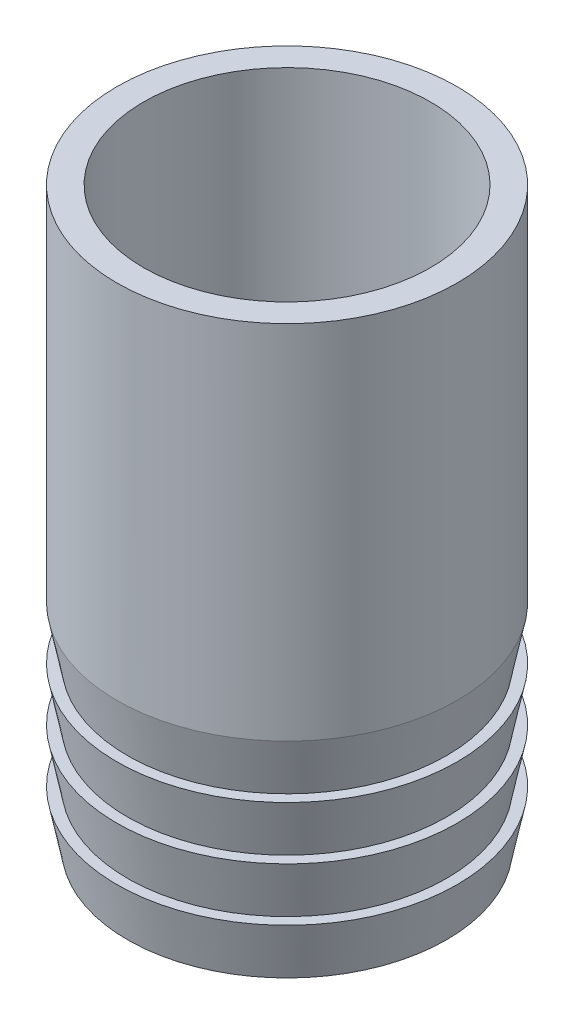
ISO-10303-21;
HEADER;
FILE_DESCRIPTION(('STEP AP214'),'2;1');
FILE_NAME('part.step','',(''),(''),'','','');
FILE_SCHEMA(('AUTOMOTIVE_DESIGN { 1 0 10303 214 1 1 1 1 }'));
ENDSEC;
DATA;
#1=APPLICATION_CONTEXT('core data for automotive mechanical design processes');
#2=APPLICATION_PROTOCOL_DEFINITION('international standard','automotive_design',2000,#1);
#3=PRODUCT_CONTEXT('',#1,'mechanical');
#4=PRODUCT('Part','Part','',(#3));
#5=PRODUCT_RELATED_PRODUCT_CATEGORY('part','',(#4));
#6=PRODUCT_DEFINITION_FORMATION('','',#4);
#7=PRODUCT_DEFINITION_CONTEXT('part definition',#1,'design');
#8=PRODUCT_DEFINITION('design','',#6,#7);
#9=PRODUCT_DEFINITION_SHAPE('','',#8);
#10=(LENGTH_UNIT() NAMED_UNIT(*) SI_UNIT(.MILLI.,.METRE.));
#11=(NAMED_UNIT(*) PLANE_ANGLE_UNIT() SI_UNIT($,.RADIAN.));
#12=(NAMED_UNIT(*) SI_UNIT($,.STERADIAN.) SOLID_ANGLE_UNIT());
#13=UNCERTAINTY_MEASURE_WITH_UNIT(LENGTH_MEASURE(1.E-05),#10,'distance_accuracy_value','');
#14=(GEOMETRIC_REPRESENTATION_CONTEXT(3) GLOBAL_UNCERTAINTY_ASSIGNED_CONTEXT((#13)) GLOBAL_UNIT_ASSIGNED_CONTEXT((#10,
#11,#12)) REPRESENTATION_CONTEXT('',''));
#15=CARTESIAN_POINT('',(0.,0.,0.));
#16=DIRECTION('',(0.,0.,1.));
#17=DIRECTION('',(1.,0.,0.));
#18=AXIS2_PLACEMENT_3D('',#15,#16,#17);
#19=CARTESIAN_POINT('',(0.,0.,0.));
#20=DIRECTION('',(0.,1.,0.));
#21=DIRECTION('',(0.,0.,1.));
#22=AXIS2_PLACEMENT_3D('',#19,#20,#21);
#23=PLANE('',#22);
#24=CARTESIAN_POINT('',(0.,0.,0.));
#25=DIRECTION('',(0.,1.,0.));
#26=DIRECTION('',(0.,0.,1.));
#27=AXIS2_PLACEMENT_3D('',#24,#25,#26);
#28=CIRCLE('',#27,13.5);
#29=CARTESIAN_POINT('',(0.,0.,13.5));
#30=VERTEX_POINT('',#29);
#31=EDGE_CURVE('E52',#30,#30,#28,.T.);
#32=ORIENTED_EDGE('',*,*,#31,.T.);
#33=EDGE_LOOP('',(#32));
#34=FACE_BOUND('',#33,.T.);
#35=CARTESIAN_POINT('',(0.,-1.53647213295989E-13,0.));
#36=DIRECTION('',(0.,-1.,0.));
#37=DIRECTION('',(1.,0.,0.));
#38=AXIS2_PLACEMENT_3D('',#35,#36,#37);
#39=CIRCLE('',#38,15.0000000000002);
#40=CARTESIAN_POINT('',(15.0000000000002,0.,0.));
#41=VERTEX_POINT('',#40);
#42=EDGE_CURVE('E76',#41,#41,#39,.T.);
#43=ORIENTED_EDGE('',*,*,#42,.T.);
#44=EDGE_LOOP('',(#43));
#45=FACE_BOUND('',#44,.T.);
#46=ADVANCED_FACE('F39',(#34,#45),#23,.F.);
#47=CARTESIAN_POINT('',(0.,54.,0.));
#48=DIRECTION('',(0.,1.,0.));
#49=DIRECTION('',(0.,0.,1.));
#50=AXIS2_PLACEMENT_3D('',#47,#48,#49);
#51=PLANE('',#50);
#52=CARTESIAN_POINT('',(0.,54.,0.));
#53=DIRECTION('',(0.,1.,0.));
#54=DIRECTION('',(0.,0.,1.));
#55=AXIS2_PLACEMENT_3D('',#52,#53,#54);
#56=CIRCLE('',#55,16.);
#57=CARTESIAN_POINT('',(0.,54.,16.));
#58=VERTEX_POINT('',#57);
#59=EDGE_CURVE('E10',#58,#58,#56,.T.);
#60=ORIENTED_EDGE('',*,*,#59,.T.);
#61=EDGE_LOOP('',(#60));
#62=FACE_BOUND('',#61,.T.);
#63=CARTESIAN_POINT('',(0.,54.,0.));
#64=DIRECTION('',(0.,1.,0.));
#65=DIRECTION('',(0.,0.,1.));
#66=AXIS2_PLACEMENT_3D('',#63,#64,#65);
#67=CIRCLE('',#66,13.5);
#68=CARTESIAN_POINT('',(0.,54.,13.5));
#69=VERTEX_POINT('',#68);
#70=EDGE_CURVE('E47',#69,#69,#67,.T.);
#71=ORIENTED_EDGE('',*,*,#70,.F.);
#72=EDGE_LOOP('',(#71));
#73=FACE_BOUND('',#72,.T.);
#74=ADVANCED_FACE('F116',(#62,#73),#51,.T.);
#75=CARTESIAN_POINT('',(0.,54.,0.));
#76=DIRECTION('',(0.,-1.,0.));
#77=DIRECTION('',(0.,0.,-1.));
#78=AXIS2_PLACEMENT_3D('',#75,#76,#77);
#79=CYLINDRICAL_SURFACE('',#78,16.);
#80=CARTESIAN_POINT('',(-2.09488880330586E-13,19.9999999999998,0.));
#81=DIRECTION('',(0.,-1.,0.));
#82=DIRECTION('',(1.,0.,0.));
#83=AXIS2_PLACEMENT_3D('',#80,#81,#82);
#84=CIRCLE('',#83,16.0000000000002);
#85=CARTESIAN_POINT('',(16.,20.,0.));
#86=VERTEX_POINT('',#85);
#87=EDGE_CURVE('E60',#86,#86,#84,.T.);
#88=ORIENTED_EDGE('',*,*,#87,.F.);
#89=EDGE_LOOP('',(#88));
#90=FACE_BOUND('',#89,.T.);
#91=ORIENTED_EDGE('',*,*,#59,.F.);
#92=EDGE_LOOP('',(#91));
#93=FACE_BOUND('',#92,.T.);
#94=ADVANCED_FACE('F41',(#90,#93),#79,.T.);
#95=CARTESIAN_POINT('',(0.,54.,0.));
#96=DIRECTION('',(0.,-1.,0.));
#97=DIRECTION('',(0.,0.,-1.));
#98=AXIS2_PLACEMENT_3D('',#95,#96,#97);
#99=CYLINDRICAL_SURFACE('',#98,13.5);
#100=ORIENTED_EDGE('',*,*,#70,.T.);
#101=EDGE_LOOP('',(#100));
#102=FACE_BOUND('',#101,.T.);
#103=ORIENTED_EDGE('',*,*,#31,.F.);
#104=EDGE_LOOP('',(#103));
#105=FACE_BOUND('',#104,.T.);
#106=ADVANCED_FACE('F105',(#102,#105),#99,.F.);
#107=CARTESIAN_POINT('',(15.,15.,0.));
#108=DIRECTION('',(0.,-1.,0.));
#109=DIRECTION('',(1.,0.,0.));
#110=AXIS2_PLACEMENT_3D('',#107,#108,#109);
#111=PLANE('',#110);
#112=CARTESIAN_POINT('',(-1.57116660247939E-13,14.9999999999998,0.));
#113=DIRECTION('',(0.,-1.,0.));
#114=DIRECTION('',(1.,0.,0.));
#115=AXIS2_PLACEMENT_3D('',#112,#113,#114);
#116=CIRCLE('',#115,16.0000000000002);
#117=CARTESIAN_POINT('',(16.,15.,0.));
#118=VERTEX_POINT('',#117);
#119=EDGE_CURVE('E84',#118,#118,#116,.T.);
#120=ORIENTED_EDGE('',*,*,#119,.F.);
#121=EDGE_LOOP('',(#120));
#122=FACE_BOUND('',#121,.T.);
#123=CARTESIAN_POINT('',(-1.57116660247939E-13,14.9999999999998,0.));
#124=DIRECTION('',(0.,-1.,0.));
#125=DIRECTION('',(1.,0.,0.));
#126=AXIS2_PLACEMENT_3D('',#123,#124,#125);
#127=CIRCLE('',#126,15.0000000000002);
#128=CARTESIAN_POINT('',(15.,15.,0.));
#129=VERTEX_POINT('',#128);
#130=EDGE_CURVE('E64',#129,#129,#127,.T.);
#131=ORIENTED_EDGE('',*,*,#130,.T.);
#132=EDGE_LOOP('',(#131));
#133=FACE_BOUND('',#132,.T.);
#134=ADVANCED_FACE('F101',(#122,#133),#111,.F.);
#135=CARTESIAN_POINT('',(-2.09488880330586E-13,19.9999999999998,0.));
#136=DIRECTION('',(0.,1.,0.));
#137=DIRECTION('',(-1.,0.,0.));
#138=AXIS2_PLACEMENT_3D('',#135,#136,#137);
#139=CONICAL_SURFACE('',#138,16.0000000000002,0.197395559849891);
#140=ORIENTED_EDGE('',*,*,#130,.F.);
#141=EDGE_LOOP('',(#140));
#142=FACE_BOUND('',#141,.T.);
#143=ORIENTED_EDGE('',*,*,#87,.T.);
#144=EDGE_LOOP('',(#143));
#145=FACE_BOUND('',#144,.T.);
#146=ADVANCED_FACE('F104',(#142,#145),#139,.T.);
#147=CARTESIAN_POINT('',(15.0000000000001,9.99999999999999,0.));
#148=DIRECTION('',(0.,-1.,0.));
#149=DIRECTION('',(1.,0.,0.));
#150=AXIS2_PLACEMENT_3D('',#147,#148,#149);
#151=PLANE('',#150);
#152=CARTESIAN_POINT('',(-1.04744440165292E-13,9.99999999999983,0.));
#153=DIRECTION('',(0.,-1.,0.));
#154=DIRECTION('',(1.,0.,0.));
#155=AXIS2_PLACEMENT_3D('',#152,#153,#154);
#156=CIRCLE('',#155,16.0000000000002);
#157=CARTESIAN_POINT('',(16.0000000000001,10.,0.));
#158=VERTEX_POINT('',#157);
#159=EDGE_CURVE('E80',#158,#158,#156,.T.);
#160=ORIENTED_EDGE('',*,*,#159,.F.);
#161=EDGE_LOOP('',(#160));
#162=FACE_BOUND('',#161,.T.);
#163=CARTESIAN_POINT('',(-1.04744440165292E-13,9.99999999999984,0.));
#164=DIRECTION('',(0.,-1.,0.));
#165=DIRECTION('',(1.,0.,0.));
#166=AXIS2_PLACEMENT_3D('',#163,#164,#165);
#167=CIRCLE('',#166,15.0000000000002);
#168=CARTESIAN_POINT('',(15.0000000000001,10.,0.));
#169=VERTEX_POINT('',#168);
#170=EDGE_CURVE('E68',#169,#169,#167,.T.);
#171=ORIENTED_EDGE('',*,*,#170,.T.);
#172=EDGE_LOOP('',(#171));
#173=FACE_BOUND('',#172,.T.);
#174=ADVANCED_FACE('F92',(#162,#173),#151,.F.);
#175=CARTESIAN_POINT('',(-1.57116660247939E-13,14.9999999999998,0.));
#176=DIRECTION('',(0.,1.,0.));
#177=DIRECTION('',(-1.,0.,0.));
#178=AXIS2_PLACEMENT_3D('',#175,#176,#177);
#179=CONICAL_SURFACE('',#178,16.0000000000002,0.197395559849891);
#180=ORIENTED_EDGE('',*,*,#170,.F.);
#181=EDGE_LOOP('',(#180));
#182=FACE_BOUND('',#181,.T.);
#183=ORIENTED_EDGE('',*,*,#119,.T.);
#184=EDGE_LOOP('',(#183));
#185=FACE_BOUND('',#184,.T.);
#186=ADVANCED_FACE('F94',(#182,#185),#179,.T.);
#187=CARTESIAN_POINT('',(0.,4.99999999999984,0.));
#188=DIRECTION('',(0.,1.,0.));
#189=DIRECTION('',(-1.,0.,0.));
#190=AXIS2_PLACEMENT_3D('',#187,#188,#189);
#191=CONICAL_SURFACE('',#190,16.0000000000002,0.197395559849891);
#192=ORIENTED_EDGE('',*,*,#42,.F.);
#193=EDGE_LOOP('',(#192));
#194=FACE_BOUND('',#193,.T.);
#195=CARTESIAN_POINT('',(0.,4.99999999999983,0.));
#196=DIRECTION('',(0.,-1.,0.));
#197=DIRECTION('',(1.,0.,0.));
#198=AXIS2_PLACEMENT_3D('',#195,#196,#197);
#199=CIRCLE('',#198,16.0000000000002);
#200=CARTESIAN_POINT('',(16.0000000000001,5.,0.));
#201=VERTEX_POINT('',#200);
#202=EDGE_CURVE('E72',#201,#201,#199,.T.);
#203=ORIENTED_EDGE('',*,*,#202,.T.);
#204=EDGE_LOOP('',(#203));
#205=FACE_BOUND('',#204,.T.);
#206=ADVANCED_FACE('F97',(#194,#205),#191,.T.);
#207=CARTESIAN_POINT('',(-1.04744440165292E-13,9.99999999999983,0.));
#208=DIRECTION('',(0.,1.,0.));
#209=DIRECTION('',(-1.,0.,0.));
#210=AXIS2_PLACEMENT_3D('',#207,#208,#209);
#211=CONICAL_SURFACE('',#210,16.0000000000002,0.197395559849891);
#212=CARTESIAN_POINT('',(0.,4.99999999999984,0.));
#213=DIRECTION('',(0.,-1.,0.));
#214=DIRECTION('',(1.,0.,0.));
#215=AXIS2_PLACEMENT_3D('',#212,#213,#214);
#216=CIRCLE('',#215,15.0000000000002);
#217=CARTESIAN_POINT('',(15.0000000000001,5.,0.));
#218=VERTEX_POINT('',#217);
#219=EDGE_CURVE('E58',#218,#218,#216,.T.);
#220=ORIENTED_EDGE('',*,*,#219,.F.);
#221=EDGE_LOOP('',(#220));
#222=FACE_BOUND('',#221,.T.);
#223=ORIENTED_EDGE('',*,*,#159,.T.);
#224=EDGE_LOOP('',(#223));
#225=FACE_BOUND('',#224,.T.);
#226=ADVANCED_FACE('F132',(#222,#225),#211,.T.);
#227=CARTESIAN_POINT('',(15.0000000000001,5.,0.));
#228=DIRECTION('',(0.,-1.,0.));
#229=DIRECTION('',(1.,0.,0.));
#230=AXIS2_PLACEMENT_3D('',#227,#228,#229);
#231=PLANE('',#230);
#232=ORIENTED_EDGE('',*,*,#202,.F.);
#233=EDGE_LOOP('',(#232));
#234=FACE_BOUND('',#233,.T.);
#235=ORIENTED_EDGE('',*,*,#219,.T.);
#236=EDGE_LOOP('',(#235));
#237=FACE_BOUND('',#236,.T.);
#238=ADVANCED_FACE('F129',(#234,#237),#231,.F.);
#239=CLOSED_SHELL('',(#46,#74,#94,#106,#134,#146,#174,#186,#206,#226,#238));
#240=MANIFOLD_SOLID_BREP('B2',#239);
#241=ADVANCED_BREP_SHAPE_REPRESENTATION('',(#18,#240),#14);
#242=SHAPE_DEFINITION_REPRESENTATION(#9,#241);
ENDSEC;
END-ISO-10303-21;
